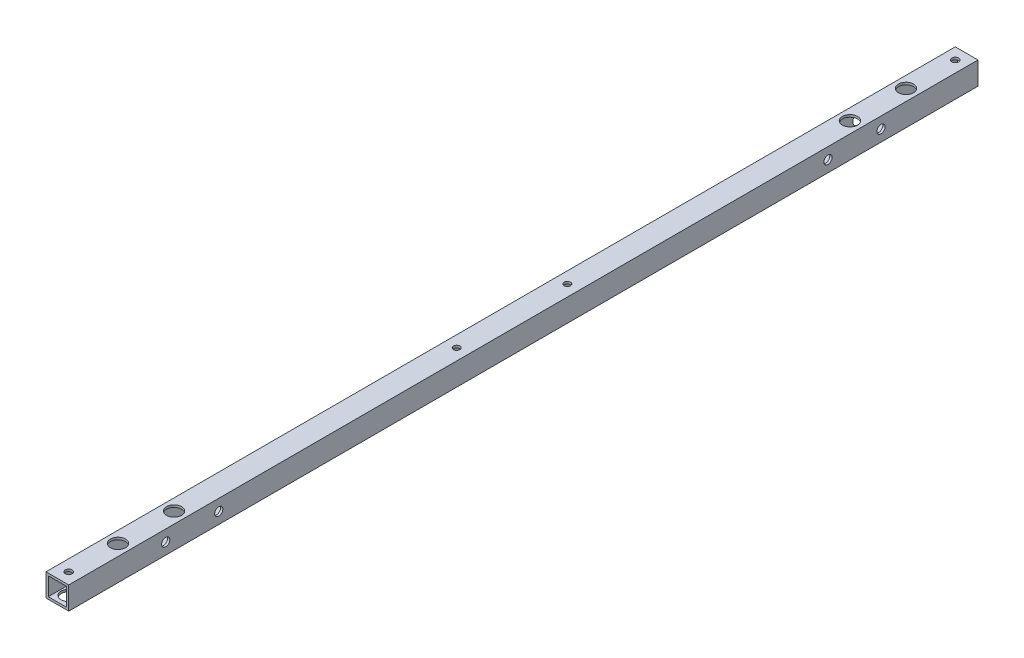
ISO-10303-21;
HEADER;
FILE_DESCRIPTION(('STEP AP214'),'2;1');
FILE_NAME('part.step','',(''),(''),'','','');
FILE_SCHEMA(('AUTOMOTIVE_DESIGN { 1 0 10303 214 1 1 1 1 }'));
ENDSEC;
DATA;
#1=APPLICATION_CONTEXT('core data for automotive mechanical design processes');
#2=APPLICATION_PROTOCOL_DEFINITION('international standard','automotive_design',2000,#1);
#3=PRODUCT_CONTEXT('',#1,'mechanical');
#4=PRODUCT('Part','Part','',(#3));
#5=PRODUCT_RELATED_PRODUCT_CATEGORY('part','',(#4));
#6=PRODUCT_DEFINITION_FORMATION('','',#4);
#7=PRODUCT_DEFINITION_CONTEXT('part definition',#1,'design');
#8=PRODUCT_DEFINITION('design','',#6,#7);
#9=PRODUCT_DEFINITION_SHAPE('','',#8);
#10=(LENGTH_UNIT() NAMED_UNIT(*) SI_UNIT(.MILLI.,.METRE.));
#11=(NAMED_UNIT(*) PLANE_ANGLE_UNIT() SI_UNIT($,.RADIAN.));
#12=(NAMED_UNIT(*) SI_UNIT($,.STERADIAN.) SOLID_ANGLE_UNIT());
#13=UNCERTAINTY_MEASURE_WITH_UNIT(LENGTH_MEASURE(1.E-05),#10,'distance_accuracy_value','');
#14=(GEOMETRIC_REPRESENTATION_CONTEXT(3) GLOBAL_UNCERTAINTY_ASSIGNED_CONTEXT((#13)) GLOBAL_UNIT_ASSIGNED_CONTEXT((#10,
#11,#12)) REPRESENTATION_CONTEXT('',''));
#15=CARTESIAN_POINT('',(0.,0.,0.));
#16=DIRECTION('',(0.,0.,1.));
#17=DIRECTION('',(1.,0.,0.));
#18=AXIS2_PLACEMENT_3D('',#15,#16,#17);
#19=CARTESIAN_POINT('',(-7.5,-7.5,600.));
#20=DIRECTION('',(1.,0.,0.));
#21=DIRECTION('',(0.,0.,-1.));
#22=AXIS2_PLACEMENT_3D('',#19,#20,#21);
#23=PLANE('',#22);
#24=CARTESIAN_POINT('',(-7.5,0.,536.));
#25=DIRECTION('',(-1.,0.,0.));
#26=DIRECTION('',(0.,0.,1.));
#27=AXIS2_PLACEMENT_3D('',#24,#25,#26);
#28=CIRCLE('',#27,4.99999999999999);
#29=CARTESIAN_POINT('',(-7.5,0.,541.));
#30=VERTEX_POINT('',#29);
#31=EDGE_CURVE('E427',#30,#30,#28,.T.);
#32=ORIENTED_EDGE('',*,*,#31,.F.);
#33=EDGE_LOOP('',(#32));
#34=FACE_BOUND('',#33,.T.);
#35=DIRECTION('',(0.,-1.,0.));
#36=VECTOR('',#35,1.);
#37=CARTESIAN_POINT('',(-7.5,-7.5,0.));
#38=LINE('',#37,#36);
#39=CARTESIAN_POINT('',(-7.5,7.5,0.));
#40=VERTEX_POINT('',#39);
#41=CARTESIAN_POINT('',(-7.5,-7.5,0.));
#42=VERTEX_POINT('',#41);
#43=EDGE_CURVE('E160',#40,#42,#38,.T.);
#44=ORIENTED_EDGE('',*,*,#43,.T.);
#45=DIRECTION('',(0.,0.,-1.));
#46=VECTOR('',#45,1.);
#47=CARTESIAN_POINT('',(-7.5,-7.5,600.));
#48=LINE('',#47,#46);
#49=CARTESIAN_POINT('',(-7.5,-7.5,600.));
#50=VERTEX_POINT('',#49);
#51=EDGE_CURVE('E165',#50,#42,#48,.T.);
#52=ORIENTED_EDGE('',*,*,#51,.F.);
#53=DIRECTION('',(0.,-1.,0.));
#54=VECTOR('',#53,1.);
#55=CARTESIAN_POINT('',(-7.5,-7.5,600.));
#56=LINE('',#55,#54);
#57=CARTESIAN_POINT('',(-7.5,7.5,600.));
#58=VERTEX_POINT('',#57);
#59=EDGE_CURVE('E151',#58,#50,#56,.T.);
#60=ORIENTED_EDGE('',*,*,#59,.F.);
#61=DIRECTION('',(0.,0.,-1.));
#62=VECTOR('',#61,1.);
#63=CARTESIAN_POINT('',(-7.5,7.5,600.));
#64=LINE('',#63,#62);
#65=EDGE_CURVE('E48',#58,#40,#64,.T.);
#66=ORIENTED_EDGE('',*,*,#65,.T.);
#67=EDGE_LOOP('',(#44,#52,#60,#66));
#68=FACE_BOUND('',#67,.T.);
#69=CARTESIAN_POINT('',(-7.5,0.,501.));
#70=DIRECTION('',(-1.,0.,0.));
#71=DIRECTION('',(0.,0.,1.));
#72=AXIS2_PLACEMENT_3D('',#69,#70,#71);
#73=CIRCLE('',#72,4.99999999999999);
#74=CARTESIAN_POINT('',(-7.5,0.,506.));
#75=VERTEX_POINT('',#74);
#76=EDGE_CURVE('E605',#75,#75,#73,.T.);
#77=ORIENTED_EDGE('',*,*,#76,.F.);
#78=EDGE_LOOP('',(#77));
#79=FACE_BOUND('',#78,.T.);
#80=CARTESIAN_POINT('',(-7.5,0.,99.));
#81=DIRECTION('',(-1.,0.,0.));
#82=DIRECTION('',(0.,0.,1.));
#83=AXIS2_PLACEMENT_3D('',#80,#81,#82);
#84=CIRCLE('',#83,4.99999999999999);
#85=CARTESIAN_POINT('',(-7.5,0.,104.));
#86=VERTEX_POINT('',#85);
#87=EDGE_CURVE('E597',#86,#86,#84,.T.);
#88=ORIENTED_EDGE('',*,*,#87,.F.);
#89=EDGE_LOOP('',(#88));
#90=FACE_BOUND('',#89,.T.);
#91=CARTESIAN_POINT('',(-7.5,0.,64.));
#92=DIRECTION('',(-1.,0.,0.));
#93=DIRECTION('',(0.,0.,1.));
#94=AXIS2_PLACEMENT_3D('',#91,#92,#93);
#95=CIRCLE('',#94,4.99999999999999);
#96=CARTESIAN_POINT('',(-7.5,0.,69.));
#97=VERTEX_POINT('',#96);
#98=EDGE_CURVE('E594',#97,#97,#95,.T.);
#99=ORIENTED_EDGE('',*,*,#98,.F.);
#100=EDGE_LOOP('',(#99));
#101=FACE_BOUND('',#100,.T.);
#102=ADVANCED_FACE('F39',(#34,#68,#79,#90,#101),#23,.F.);
#103=CARTESIAN_POINT('',(-6.,-6.,600.));
#104=DIRECTION('',(1.,0.,0.));
#105=DIRECTION('',(0.,0.,-1.));
#106=AXIS2_PLACEMENT_3D('',#103,#104,#105);
#107=PLANE('',#106);
#108=CARTESIAN_POINT('',(-6.,0.,64.));
#109=DIRECTION('',(-1.,0.,0.));
#110=DIRECTION('',(0.,0.,1.));
#111=AXIS2_PLACEMENT_3D('',#108,#109,#110);
#112=CIRCLE('',#111,4.99999999999999);
#113=CARTESIAN_POINT('',(-6.,0.,69.));
#114=VERTEX_POINT('',#113);
#115=EDGE_CURVE('E591',#114,#114,#112,.T.);
#116=ORIENTED_EDGE('',*,*,#115,.T.);
#117=EDGE_LOOP('',(#116));
#118=FACE_BOUND('',#117,.T.);
#119=CARTESIAN_POINT('',(-6.,0.,99.));
#120=DIRECTION('',(-1.,0.,0.));
#121=DIRECTION('',(0.,0.,1.));
#122=AXIS2_PLACEMENT_3D('',#119,#120,#121);
#123=CIRCLE('',#122,4.99999999999999);
#124=CARTESIAN_POINT('',(-6.,0.,104.));
#125=VERTEX_POINT('',#124);
#126=EDGE_CURVE('E602',#125,#125,#123,.T.);
#127=ORIENTED_EDGE('',*,*,#126,.T.);
#128=EDGE_LOOP('',(#127));
#129=FACE_BOUND('',#128,.T.);
#130=CARTESIAN_POINT('',(-6.,0.,501.));
#131=DIRECTION('',(-1.,0.,0.));
#132=DIRECTION('',(0.,0.,1.));
#133=AXIS2_PLACEMENT_3D('',#130,#131,#132);
#134=CIRCLE('',#133,4.99999999999999);
#135=CARTESIAN_POINT('',(-6.,0.,506.));
#136=VERTEX_POINT('',#135);
#137=EDGE_CURVE('E433',#136,#136,#134,.T.);
#138=ORIENTED_EDGE('',*,*,#137,.T.);
#139=EDGE_LOOP('',(#138));
#140=FACE_BOUND('',#139,.T.);
#141=DIRECTION('',(0.,-1.,0.));
#142=VECTOR('',#141,1.);
#143=CARTESIAN_POINT('',(-6.,-6.,0.));
#144=LINE('',#143,#142);
#145=CARTESIAN_POINT('',(-6.,6.,0.));
#146=VERTEX_POINT('',#145);
#147=CARTESIAN_POINT('',(-6.,-6.,0.));
#148=VERTEX_POINT('',#147);
#149=EDGE_CURVE('E137',#146,#148,#144,.T.);
#150=ORIENTED_EDGE('',*,*,#149,.F.);
#151=DIRECTION('',(0.,0.,-1.));
#152=VECTOR('',#151,1.);
#153=CARTESIAN_POINT('',(-6.,6.,600.));
#154=LINE('',#153,#152);
#155=CARTESIAN_POINT('',(-6.,6.,600.));
#156=VERTEX_POINT('',#155);
#157=EDGE_CURVE('E123',#156,#146,#154,.T.);
#158=ORIENTED_EDGE('',*,*,#157,.F.);
#159=DIRECTION('',(0.,-1.,0.));
#160=VECTOR('',#159,1.);
#161=CARTESIAN_POINT('',(-6.,-6.,600.));
#162=LINE('',#161,#160);
#163=CARTESIAN_POINT('',(-6.,-6.,600.));
#164=VERTEX_POINT('',#163);
#165=EDGE_CURVE('E127',#156,#164,#162,.T.);
#166=ORIENTED_EDGE('',*,*,#165,.T.);
#167=DIRECTION('',(0.,0.,-1.));
#168=VECTOR('',#167,1.);
#169=CARTESIAN_POINT('',(-6.,-6.,600.));
#170=LINE('',#169,#168);
#171=EDGE_CURVE('E56',#164,#148,#170,.T.);
#172=ORIENTED_EDGE('',*,*,#171,.T.);
#173=EDGE_LOOP('',(#150,#158,#166,#172));
#174=FACE_BOUND('',#173,.T.);
#175=CARTESIAN_POINT('',(-6.,0.,536.));
#176=DIRECTION('',(-1.,0.,0.));
#177=DIRECTION('',(0.,0.,1.));
#178=AXIS2_PLACEMENT_3D('',#175,#176,#177);
#179=CIRCLE('',#178,4.99999999999999);
#180=CARTESIAN_POINT('',(-6.,0.,541.));
#181=VERTEX_POINT('',#180);
#182=EDGE_CURVE('E424',#181,#181,#179,.T.);
#183=ORIENTED_EDGE('',*,*,#182,.T.);
#184=EDGE_LOOP('',(#183));
#185=FACE_BOUND('',#184,.T.);
#186=ADVANCED_FACE('F318',(#118,#129,#140,#174,#185),#107,.T.);
#187=CARTESIAN_POINT('',(0.,0.,600.));
#188=DIRECTION('',(0.,0.,-1.));
#189=DIRECTION('',(-1.,0.,0.));
#190=AXIS2_PLACEMENT_3D('',#187,#188,#189);
#191=PLANE('',#190);
#192=DIRECTION('',(0.,1.,0.));
#193=VECTOR('',#192,1.);
#194=CARTESIAN_POINT('',(7.5,-7.5,600.));
#195=LINE('',#194,#193);
#196=CARTESIAN_POINT('',(7.5,-7.5,600.));
#197=VERTEX_POINT('',#196);
#198=CARTESIAN_POINT('',(7.5,7.5,600.));
#199=VERTEX_POINT('',#198);
#200=EDGE_CURVE('E145',#197,#199,#195,.T.);
#201=ORIENTED_EDGE('',*,*,#200,.T.);
#202=DIRECTION('',(-1.,0.,0.));
#203=VECTOR('',#202,1.);
#204=CARTESIAN_POINT('',(-7.5,7.5,600.));
#205=LINE('',#204,#203);
#206=EDGE_CURVE('E148',#199,#58,#205,.T.);
#207=ORIENTED_EDGE('',*,*,#206,.T.);
#208=ORIENTED_EDGE('',*,*,#59,.T.);
#209=DIRECTION('',(1.,0.,0.));
#210=VECTOR('',#209,1.);
#211=CARTESIAN_POINT('',(-7.5,-7.5,600.));
#212=LINE('',#211,#210);
#213=EDGE_CURVE('E153',#50,#197,#212,.T.);
#214=ORIENTED_EDGE('',*,*,#213,.T.);
#215=EDGE_LOOP('',(#201,#207,#208,#214));
#216=FACE_BOUND('',#215,.T.);
#217=DIRECTION('',(0.,1.,0.));
#218=VECTOR('',#217,1.);
#219=CARTESIAN_POINT('',(6.,-6.,600.));
#220=LINE('',#219,#218);
#221=CARTESIAN_POINT('',(6.,-6.,600.));
#222=VERTEX_POINT('',#221);
#223=CARTESIAN_POINT('',(6.,6.,600.));
#224=VERTEX_POINT('',#223);
#225=EDGE_CURVE('E106',#222,#224,#220,.T.);
#226=ORIENTED_EDGE('',*,*,#225,.F.);
#227=DIRECTION('',(1.,0.,0.));
#228=VECTOR('',#227,1.);
#229=CARTESIAN_POINT('',(-6.,-6.,600.));
#230=LINE('',#229,#228);
#231=EDGE_CURVE('E129',#164,#222,#230,.T.);
#232=ORIENTED_EDGE('',*,*,#231,.F.);
#233=ORIENTED_EDGE('',*,*,#165,.F.);
#234=DIRECTION('',(-1.,0.,0.));
#235=VECTOR('',#234,1.);
#236=CARTESIAN_POINT('',(-6.,6.,600.));
#237=LINE('',#236,#235);
#238=EDGE_CURVE('E114',#224,#156,#237,.T.);
#239=ORIENTED_EDGE('',*,*,#238,.F.);
#240=EDGE_LOOP('',(#226,#232,#233,#239));
#241=FACE_BOUND('',#240,.T.);
#242=ADVANCED_FACE('F126',(#216,#241),#191,.F.);
#243=CARTESIAN_POINT('',(0.,0.,0.));
#244=DIRECTION('',(0.,0.,-1.));
#245=DIRECTION('',(-1.,0.,0.));
#246=AXIS2_PLACEMENT_3D('',#243,#244,#245);
#247=PLANE('',#246);
#248=DIRECTION('',(0.,1.,0.));
#249=VECTOR('',#248,1.);
#250=CARTESIAN_POINT('',(7.5,-7.5,0.));
#251=LINE('',#250,#249);
#252=CARTESIAN_POINT('',(7.5,-7.5,0.));
#253=VERTEX_POINT('',#252);
#254=CARTESIAN_POINT('',(7.5,7.5,0.));
#255=VERTEX_POINT('',#254);
#256=EDGE_CURVE('E122',#253,#255,#251,.T.);
#257=ORIENTED_EDGE('',*,*,#256,.F.);
#258=DIRECTION('',(1.,0.,0.));
#259=VECTOR('',#258,1.);
#260=CARTESIAN_POINT('',(-7.5,-7.5,0.));
#261=LINE('',#260,#259);
#262=EDGE_CURVE('E149',#42,#253,#261,.T.);
#263=ORIENTED_EDGE('',*,*,#262,.F.);
#264=ORIENTED_EDGE('',*,*,#43,.F.);
#265=DIRECTION('',(-1.,0.,0.));
#266=VECTOR('',#265,1.);
#267=CARTESIAN_POINT('',(-7.5,7.5,0.));
#268=LINE('',#267,#266);
#269=EDGE_CURVE('E158',#255,#40,#268,.T.);
#270=ORIENTED_EDGE('',*,*,#269,.F.);
#271=EDGE_LOOP('',(#257,#263,#264,#270));
#272=FACE_BOUND('',#271,.T.);
#273=DIRECTION('',(1.,0.,0.));
#274=VECTOR('',#273,1.);
#275=CARTESIAN_POINT('',(-6.,-6.,0.));
#276=LINE('',#275,#274);
#277=CARTESIAN_POINT('',(6.,-6.,0.));
#278=VERTEX_POINT('',#277);
#279=EDGE_CURVE('E115',#148,#278,#276,.T.);
#280=ORIENTED_EDGE('',*,*,#279,.T.);
#281=DIRECTION('',(0.,1.,0.));
#282=VECTOR('',#281,1.);
#283=CARTESIAN_POINT('',(6.,-6.,0.));
#284=LINE('',#283,#282);
#285=CARTESIAN_POINT('',(6.,6.,0.));
#286=VERTEX_POINT('',#285);
#287=EDGE_CURVE('E64',#278,#286,#284,.T.);
#288=ORIENTED_EDGE('',*,*,#287,.T.);
#289=DIRECTION('',(-1.,0.,0.));
#290=VECTOR('',#289,1.);
#291=CARTESIAN_POINT('',(-6.,6.,0.));
#292=LINE('',#291,#290);
#293=EDGE_CURVE('E121',#286,#146,#292,.T.);
#294=ORIENTED_EDGE('',*,*,#293,.T.);
#295=ORIENTED_EDGE('',*,*,#149,.T.);
#296=EDGE_LOOP('',(#280,#288,#294,#295));
#297=FACE_BOUND('',#296,.T.);
#298=ADVANCED_FACE('F309',(#272,#297),#247,.T.);
#299=CARTESIAN_POINT('',(7.5,-7.5,600.));
#300=DIRECTION('',(-1.,0.,0.));
#301=DIRECTION('',(0.,0.,1.));
#302=AXIS2_PLACEMENT_3D('',#299,#300,#301);
#303=PLANE('',#302);
#304=CARTESIAN_POINT('',(7.5,0.,536.));
#305=DIRECTION('',(1.,0.,0.));
#306=DIRECTION('',(0.,0.,-1.));
#307=AXIS2_PLACEMENT_3D('',#304,#305,#306);
#308=CIRCLE('',#307,2.70000000000001);
#309=CARTESIAN_POINT('',(7.5,0.,533.3));
#310=VERTEX_POINT('',#309);
#311=EDGE_CURVE('E244',#310,#310,#308,.T.);
#312=ORIENTED_EDGE('',*,*,#311,.F.);
#313=EDGE_LOOP('',(#312));
#314=FACE_BOUND('',#313,.T.);
#315=CARTESIAN_POINT('',(7.5,0.,501.));
#316=DIRECTION('',(1.,0.,0.));
#317=DIRECTION('',(0.,0.,-1.));
#318=AXIS2_PLACEMENT_3D('',#315,#316,#317);
#319=CIRCLE('',#318,2.69999999999996);
#320=CARTESIAN_POINT('',(7.5,0.,498.3));
#321=VERTEX_POINT('',#320);
#322=EDGE_CURVE('E248',#321,#321,#319,.T.);
#323=ORIENTED_EDGE('',*,*,#322,.F.);
#324=EDGE_LOOP('',(#323));
#325=FACE_BOUND('',#324,.T.);
#326=CARTESIAN_POINT('',(7.5,0.,99.));
#327=DIRECTION('',(1.,0.,0.));
#328=DIRECTION('',(0.,0.,-1.));
#329=AXIS2_PLACEMENT_3D('',#326,#327,#328);
#330=CIRCLE('',#329,2.7);
#331=CARTESIAN_POINT('',(7.5,0.,96.3));
#332=VERTEX_POINT('',#331);
#333=EDGE_CURVE('E251',#332,#332,#330,.T.);
#334=ORIENTED_EDGE('',*,*,#333,.F.);
#335=EDGE_LOOP('',(#334));
#336=FACE_BOUND('',#335,.T.);
#337=CARTESIAN_POINT('',(7.5,0.,64.));
#338=DIRECTION('',(1.,0.,0.));
#339=DIRECTION('',(0.,0.,-1.));
#340=AXIS2_PLACEMENT_3D('',#337,#338,#339);
#341=CIRCLE('',#340,2.7);
#342=CARTESIAN_POINT('',(7.5,0.,61.3));
#343=VERTEX_POINT('',#342);
#344=EDGE_CURVE('E243',#343,#343,#341,.T.);
#345=ORIENTED_EDGE('',*,*,#344,.F.);
#346=EDGE_LOOP('',(#345));
#347=FACE_BOUND('',#346,.T.);
#348=ORIENTED_EDGE('',*,*,#256,.T.);
#349=DIRECTION('',(0.,0.,-1.));
#350=VECTOR('',#349,1.);
#351=CARTESIAN_POINT('',(7.5,7.5,600.));
#352=LINE('',#351,#350);
#353=EDGE_CURVE('E11',#199,#255,#352,.T.);
#354=ORIENTED_EDGE('',*,*,#353,.F.);
#355=ORIENTED_EDGE('',*,*,#200,.F.);
#356=DIRECTION('',(0.,0.,-1.));
#357=VECTOR('',#356,1.);
#358=CARTESIAN_POINT('',(7.5,-7.5,600.));
#359=LINE('',#358,#357);
#360=EDGE_CURVE('E155',#197,#253,#359,.T.);
#361=ORIENTED_EDGE('',*,*,#360,.T.);
#362=EDGE_LOOP('',(#348,#354,#355,#361));
#363=FACE_BOUND('',#362,.T.);
#364=ADVANCED_FACE('F41',(#314,#325,#336,#347,#363),#303,.F.);
#365=CARTESIAN_POINT('',(-7.5,7.5,600.));
#366=DIRECTION('',(0.,-1.,0.));
#367=DIRECTION('',(0.,0.,-1.));
#368=AXIS2_PLACEMENT_3D('',#365,#366,#367);
#369=PLANE('',#368);
#370=CARTESIAN_POINT('',(0.,7.5,40.));
#371=DIRECTION('',(0.,1.,0.));
#372=DIRECTION('',(0.,0.,1.));
#373=AXIS2_PLACEMENT_3D('',#370,#371,#372);
#374=CIRCLE('',#373,4.99999999999958);
#375=CARTESIAN_POINT('',(0.,7.5,44.9999999999996));
#376=VERTEX_POINT('',#375);
#377=EDGE_CURVE('E202',#376,#376,#374,.T.);
#378=ORIENTED_EDGE('',*,*,#377,.F.);
#379=EDGE_LOOP('',(#378));
#380=FACE_BOUND('',#379,.T.);
#381=CARTESIAN_POINT('',(-1.81712284108571E-12,7.5,522.999999999999));
#382=DIRECTION('',(0.,1.,0.));
#383=DIRECTION('',(0.,0.,1.));
#384=AXIS2_PLACEMENT_3D('',#381,#382,#383);
#385=CIRCLE('',#384,5.);
#386=CARTESIAN_POINT('',(-1.81712284108571E-12,7.5,527.999999999999));
#387=VERTEX_POINT('',#386);
#388=EDGE_CURVE('E426',#387,#387,#385,.T.);
#389=ORIENTED_EDGE('',*,*,#388,.F.);
#390=EDGE_LOOP('',(#389));
#391=FACE_BOUND('',#390,.T.);
#392=CARTESIAN_POINT('',(0.,7.5,560.));
#393=DIRECTION('',(0.,1.,0.));
#394=DIRECTION('',(0.,0.,1.));
#395=AXIS2_PLACEMENT_3D('',#392,#393,#394);
#396=CIRCLE('',#395,5.);
#397=CARTESIAN_POINT('',(0.,7.5,565.));
#398=VERTEX_POINT('',#397);
#399=EDGE_CURVE('E430',#398,#398,#396,.T.);
#400=ORIENTED_EDGE('',*,*,#399,.F.);
#401=EDGE_LOOP('',(#400));
#402=FACE_BOUND('',#401,.T.);
#403=CARTESIAN_POINT('',(0.,7.5,77.));
#404=DIRECTION('',(0.,1.,0.));
#405=DIRECTION('',(0.,0.,1.));
#406=AXIS2_PLACEMENT_3D('',#403,#404,#405);
#407=CIRCLE('',#406,5.);
#408=CARTESIAN_POINT('',(0.,7.5,82.));
#409=VERTEX_POINT('',#408);
#410=EDGE_CURVE('E438',#409,#409,#407,.T.);
#411=ORIENTED_EDGE('',*,*,#410,.F.);
#412=EDGE_LOOP('',(#411));
#413=FACE_BOUND('',#412,.T.);
#414=CARTESIAN_POINT('',(0.,7.5,336.5));
#415=DIRECTION('',(0.,1.,0.));
#416=DIRECTION('',(0.,0.,1.));
#417=AXIS2_PLACEMENT_3D('',#414,#415,#416);
#418=CIRCLE('',#417,2.1);
#419=CARTESIAN_POINT('',(0.,7.5,338.6));
#420=VERTEX_POINT('',#419);
#421=EDGE_CURVE('E232',#420,#420,#418,.T.);
#422=ORIENTED_EDGE('',*,*,#421,.F.);
#423=EDGE_LOOP('',(#422));
#424=FACE_BOUND('',#423,.T.);
#425=CARTESIAN_POINT('',(0.,7.5,263.5));
#426=DIRECTION('',(0.,1.,0.));
#427=DIRECTION('',(0.,0.,1.));
#428=AXIS2_PLACEMENT_3D('',#425,#426,#427);
#429=CIRCLE('',#428,2.1);
#430=CARTESIAN_POINT('',(0.,7.5,265.6));
#431=VERTEX_POINT('',#430);
#432=EDGE_CURVE('E183',#431,#431,#429,.T.);
#433=ORIENTED_EDGE('',*,*,#432,.F.);
#434=EDGE_LOOP('',(#433));
#435=FACE_BOUND('',#434,.T.);
#436=CARTESIAN_POINT('',(0.,7.5,7.49999999999995));
#437=DIRECTION('',(0.,1.,0.));
#438=DIRECTION('',(0.,0.,1.));
#439=AXIS2_PLACEMENT_3D('',#436,#437,#438);
#440=CIRCLE('',#439,2.25);
#441=CARTESIAN_POINT('',(0.,7.5,9.74999999999995));
#442=VERTEX_POINT('',#441);
#443=EDGE_CURVE('E268',#442,#442,#440,.T.);
#444=ORIENTED_EDGE('',*,*,#443,.F.);
#445=EDGE_LOOP('',(#444));
#446=FACE_BOUND('',#445,.T.);
#447=CARTESIAN_POINT('',(0.,7.5,592.5));
#448=DIRECTION('',(0.,1.,0.));
#449=DIRECTION('',(0.,0.,1.));
#450=AXIS2_PLACEMENT_3D('',#447,#448,#449);
#451=CIRCLE('',#450,2.24999999999998);
#452=CARTESIAN_POINT('',(0.,7.5,594.75));
#453=VERTEX_POINT('',#452);
#454=EDGE_CURVE('E267',#453,#453,#451,.T.);
#455=ORIENTED_EDGE('',*,*,#454,.F.);
#456=EDGE_LOOP('',(#455));
#457=FACE_BOUND('',#456,.T.);
#458=ORIENTED_EDGE('',*,*,#269,.T.);
#459=ORIENTED_EDGE('',*,*,#65,.F.);
#460=ORIENTED_EDGE('',*,*,#206,.F.);
#461=ORIENTED_EDGE('',*,*,#353,.T.);
#462=EDGE_LOOP('',(#458,#459,#460,#461));
#463=FACE_BOUND('',#462,.T.);
#464=ADVANCED_FACE('F294',(#380,#391,#402,#413,#424,#435,#446,#457,#463),#369,.F.);
#465=CARTESIAN_POINT('',(-7.5,-7.5,600.));
#466=DIRECTION('',(0.,1.,0.));
#467=DIRECTION('',(0.,0.,1.));
#468=AXIS2_PLACEMENT_3D('',#465,#466,#467);
#469=PLANE('',#468);
#470=CARTESIAN_POINT('',(0.,-7.5,40.));
#471=DIRECTION('',(0.,-1.,0.));
#472=DIRECTION('',(0.,0.,-1.));
#473=AXIS2_PLACEMENT_3D('',#470,#471,#472);
#474=CIRCLE('',#473,2.7);
#475=CARTESIAN_POINT('',(0.,-7.5,37.3));
#476=VERTEX_POINT('',#475);
#477=EDGE_CURVE('E188',#476,#476,#474,.T.);
#478=ORIENTED_EDGE('',*,*,#477,.F.);
#479=EDGE_LOOP('',(#478));
#480=FACE_BOUND('',#479,.T.);
#481=CARTESIAN_POINT('',(0.,-7.5,77.));
#482=DIRECTION('',(0.,-1.,0.));
#483=DIRECTION('',(0.,0.,-1.));
#484=AXIS2_PLACEMENT_3D('',#481,#482,#483);
#485=CIRCLE('',#484,2.7);
#486=CARTESIAN_POINT('',(0.,-7.5,74.3));
#487=VERTEX_POINT('',#486);
#488=EDGE_CURVE('E218',#487,#487,#485,.T.);
#489=ORIENTED_EDGE('',*,*,#488,.F.);
#490=EDGE_LOOP('',(#489));
#491=FACE_BOUND('',#490,.T.);
#492=CARTESIAN_POINT('',(-1.65681026646183E-12,-7.5,523.));
#493=DIRECTION('',(0.,-1.,0.));
#494=DIRECTION('',(0.,0.,-1.));
#495=AXIS2_PLACEMENT_3D('',#492,#493,#494);
#496=CIRCLE('',#495,2.69999999999999);
#497=CARTESIAN_POINT('',(-1.65681026646183E-12,-7.5,520.3));
#498=VERTEX_POINT('',#497);
#499=EDGE_CURVE('E213',#498,#498,#496,.T.);
#500=ORIENTED_EDGE('',*,*,#499,.F.);
#501=EDGE_LOOP('',(#500));
#502=FACE_BOUND('',#501,.T.);
#503=CARTESIAN_POINT('',(0.,-7.5,560.));
#504=DIRECTION('',(0.,-1.,0.));
#505=DIRECTION('',(0.,0.,-1.));
#506=AXIS2_PLACEMENT_3D('',#503,#504,#505);
#507=CIRCLE('',#506,2.69999999999999);
#508=CARTESIAN_POINT('',(0.,-7.5,557.3));
#509=VERTEX_POINT('',#508);
#510=EDGE_CURVE('E209',#509,#509,#507,.T.);
#511=ORIENTED_EDGE('',*,*,#510,.F.);
#512=EDGE_LOOP('',(#511));
#513=FACE_BOUND('',#512,.T.);
#514=CARTESIAN_POINT('',(0.,-7.5,592.5));
#515=DIRECTION('',(0.,-1.,0.));
#516=DIRECTION('',(0.,0.,-1.));
#517=AXIS2_PLACEMENT_3D('',#514,#515,#516);
#518=CIRCLE('',#517,5.);
#519=CARTESIAN_POINT('',(0.,-7.5,587.5));
#520=VERTEX_POINT('',#519);
#521=EDGE_CURVE('E174',#520,#520,#518,.T.);
#522=ORIENTED_EDGE('',*,*,#521,.F.);
#523=EDGE_LOOP('',(#522));
#524=FACE_BOUND('',#523,.T.);
#525=CARTESIAN_POINT('',(0.,-7.5,336.5));
#526=DIRECTION('',(0.,-1.,0.));
#527=DIRECTION('',(0.,0.,-1.));
#528=AXIS2_PLACEMENT_3D('',#525,#526,#527);
#529=CIRCLE('',#528,5.);
#530=CARTESIAN_POINT('',(0.,-7.5,331.5));
#531=VERTEX_POINT('',#530);
#532=EDGE_CURVE('E224',#531,#531,#529,.T.);
#533=ORIENTED_EDGE('',*,*,#532,.F.);
#534=EDGE_LOOP('',(#533));
#535=FACE_BOUND('',#534,.T.);
#536=CARTESIAN_POINT('',(0.,-7.5,263.5));
#537=DIRECTION('',(0.,-1.,0.));
#538=DIRECTION('',(0.,0.,-1.));
#539=AXIS2_PLACEMENT_3D('',#536,#537,#538);
#540=CIRCLE('',#539,5.);
#541=CARTESIAN_POINT('',(0.,-7.5,258.5));
#542=VERTEX_POINT('',#541);
#543=EDGE_CURVE('E227',#542,#542,#540,.T.);
#544=ORIENTED_EDGE('',*,*,#543,.F.);
#545=EDGE_LOOP('',(#544));
#546=FACE_BOUND('',#545,.T.);
#547=CARTESIAN_POINT('',(0.,-7.5,7.49999999999995));
#548=DIRECTION('',(0.,-1.,0.));
#549=DIRECTION('',(0.,0.,-1.));
#550=AXIS2_PLACEMENT_3D('',#547,#548,#549);
#551=CIRCLE('',#550,5.);
#552=CARTESIAN_POINT('',(0.,-7.5,2.49999999999995));
#553=VERTEX_POINT('',#552);
#554=EDGE_CURVE('E197',#553,#553,#551,.T.);
#555=ORIENTED_EDGE('',*,*,#554,.F.);
#556=EDGE_LOOP('',(#555));
#557=FACE_BOUND('',#556,.T.);
#558=ORIENTED_EDGE('',*,*,#262,.T.);
#559=ORIENTED_EDGE('',*,*,#360,.F.);
#560=ORIENTED_EDGE('',*,*,#213,.F.);
#561=ORIENTED_EDGE('',*,*,#51,.T.);
#562=EDGE_LOOP('',(#558,#559,#560,#561));
#563=FACE_BOUND('',#562,.T.);
#564=ADVANCED_FACE('F297',(#480,#491,#502,#513,#524,#535,#546,#557,#563),#469,.F.);
#565=CARTESIAN_POINT('',(6.,-6.,600.));
#566=DIRECTION('',(-1.,0.,0.));
#567=DIRECTION('',(0.,0.,1.));
#568=AXIS2_PLACEMENT_3D('',#565,#566,#567);
#569=PLANE('',#568);
#570=CARTESIAN_POINT('',(6.,0.,536.));
#571=DIRECTION('',(-1.,0.,0.));
#572=DIRECTION('',(0.,0.,1.));
#573=AXIS2_PLACEMENT_3D('',#570,#571,#572);
#574=CIRCLE('',#573,2.70000000000001);
#575=CARTESIAN_POINT('',(6.,0.,538.7));
#576=VERTEX_POINT('',#575);
#577=EDGE_CURVE('E264',#576,#576,#574,.T.);
#578=ORIENTED_EDGE('',*,*,#577,.F.);
#579=EDGE_LOOP('',(#578));
#580=FACE_BOUND('',#579,.T.);
#581=CARTESIAN_POINT('',(6.,0.,501.));
#582=DIRECTION('',(-1.,0.,0.));
#583=DIRECTION('',(0.,0.,1.));
#584=AXIS2_PLACEMENT_3D('',#581,#582,#583);
#585=CIRCLE('',#584,2.69999999999996);
#586=CARTESIAN_POINT('',(6.,0.,503.7));
#587=VERTEX_POINT('',#586);
#588=EDGE_CURVE('E261',#587,#587,#585,.T.);
#589=ORIENTED_EDGE('',*,*,#588,.F.);
#590=EDGE_LOOP('',(#589));
#591=FACE_BOUND('',#590,.T.);
#592=CARTESIAN_POINT('',(6.,0.,99.));
#593=DIRECTION('',(-1.,0.,0.));
#594=DIRECTION('',(0.,0.,1.));
#595=AXIS2_PLACEMENT_3D('',#592,#593,#594);
#596=CIRCLE('',#595,2.7);
#597=CARTESIAN_POINT('',(6.,0.,101.7));
#598=VERTEX_POINT('',#597);
#599=EDGE_CURVE('E258',#598,#598,#596,.T.);
#600=ORIENTED_EDGE('',*,*,#599,.F.);
#601=EDGE_LOOP('',(#600));
#602=FACE_BOUND('',#601,.T.);
#603=CARTESIAN_POINT('',(6.,0.,64.));
#604=DIRECTION('',(-1.,0.,0.));
#605=DIRECTION('',(0.,0.,1.));
#606=AXIS2_PLACEMENT_3D('',#603,#604,#605);
#607=CIRCLE('',#606,2.7);
#608=CARTESIAN_POINT('',(6.,0.,66.7));
#609=VERTEX_POINT('',#608);
#610=EDGE_CURVE('E247',#609,#609,#607,.T.);
#611=ORIENTED_EDGE('',*,*,#610,.F.);
#612=EDGE_LOOP('',(#611));
#613=FACE_BOUND('',#612,.T.);
#614=ORIENTED_EDGE('',*,*,#287,.F.);
#615=DIRECTION('',(0.,0.,-1.));
#616=VECTOR('',#615,1.);
#617=CARTESIAN_POINT('',(6.,-6.,600.));
#618=LINE('',#617,#616);
#619=EDGE_CURVE('E110',#222,#278,#618,.T.);
#620=ORIENTED_EDGE('',*,*,#619,.F.);
#621=ORIENTED_EDGE('',*,*,#225,.T.);
#622=DIRECTION('',(0.,0.,-1.));
#623=VECTOR('',#622,1.);
#624=CARTESIAN_POINT('',(6.,6.,600.));
#625=LINE('',#624,#623);
#626=EDGE_CURVE('E109',#224,#286,#625,.T.);
#627=ORIENTED_EDGE('',*,*,#626,.T.);
#628=EDGE_LOOP('',(#614,#620,#621,#627));
#629=FACE_BOUND('',#628,.T.);
#630=ADVANCED_FACE('F108',(#580,#591,#602,#613,#629),#569,.T.);
#631=CARTESIAN_POINT('',(-6.,6.,600.));
#632=DIRECTION('',(0.,-1.,0.));
#633=DIRECTION('',(0.,0.,-1.));
#634=AXIS2_PLACEMENT_3D('',#631,#632,#633);
#635=PLANE('',#634);
#636=CARTESIAN_POINT('',(0.,6.,40.));
#637=DIRECTION('',(0.,-1.,0.));
#638=DIRECTION('',(0.,0.,-1.));
#639=AXIS2_PLACEMENT_3D('',#636,#637,#638);
#640=CIRCLE('',#639,4.99999999999958);
#641=CARTESIAN_POINT('',(0.,6.,35.0000000000004));
#642=VERTEX_POINT('',#641);
#643=EDGE_CURVE('E43',#642,#642,#640,.T.);
#644=ORIENTED_EDGE('',*,*,#643,.F.);
#645=EDGE_LOOP('',(#644));
#646=FACE_BOUND('',#645,.T.);
#647=CARTESIAN_POINT('',(-1.81712284108571E-12,6.,522.999999999999));
#648=DIRECTION('',(0.,-1.,0.));
#649=DIRECTION('',(0.,0.,-1.));
#650=AXIS2_PLACEMENT_3D('',#647,#648,#649);
#651=CIRCLE('',#650,5.);
#652=CARTESIAN_POINT('',(-1.81712284108571E-12,6.,517.999999999999));
#653=VERTEX_POINT('',#652);
#654=EDGE_CURVE('E204',#653,#653,#651,.T.);
#655=ORIENTED_EDGE('',*,*,#654,.F.);
#656=EDGE_LOOP('',(#655));
#657=FACE_BOUND('',#656,.T.);
#658=CARTESIAN_POINT('',(0.,6.,560.));
#659=DIRECTION('',(0.,-1.,0.));
#660=DIRECTION('',(0.,0.,-1.));
#661=AXIS2_PLACEMENT_3D('',#658,#659,#660);
#662=CIRCLE('',#661,5.);
#663=CARTESIAN_POINT('',(0.,6.,555.));
#664=VERTEX_POINT('',#663);
#665=EDGE_CURVE('E201',#664,#664,#662,.T.);
#666=ORIENTED_EDGE('',*,*,#665,.F.);
#667=EDGE_LOOP('',(#666));
#668=FACE_BOUND('',#667,.T.);
#669=CARTESIAN_POINT('',(0.,6.,77.));
#670=DIRECTION('',(0.,-1.,0.));
#671=DIRECTION('',(0.,0.,-1.));
#672=AXIS2_PLACEMENT_3D('',#669,#670,#671);
#673=CIRCLE('',#672,5.);
#674=CARTESIAN_POINT('',(0.,6.,72.));
#675=VERTEX_POINT('',#674);
#676=EDGE_CURVE('E198',#675,#675,#673,.T.);
#677=ORIENTED_EDGE('',*,*,#676,.F.);
#678=EDGE_LOOP('',(#677));
#679=FACE_BOUND('',#678,.T.);
#680=CARTESIAN_POINT('',(0.,6.,336.5));
#681=DIRECTION('',(0.,-1.,0.));
#682=DIRECTION('',(0.,0.,-1.));
#683=AXIS2_PLACEMENT_3D('',#680,#681,#682);
#684=CIRCLE('',#683,2.1);
#685=CARTESIAN_POINT('',(0.,6.,334.4));
#686=VERTEX_POINT('',#685);
#687=EDGE_CURVE('E240',#686,#686,#684,.T.);
#688=ORIENTED_EDGE('',*,*,#687,.F.);
#689=EDGE_LOOP('',(#688));
#690=FACE_BOUND('',#689,.T.);
#691=CARTESIAN_POINT('',(0.,6.,263.5));
#692=DIRECTION('',(0.,-1.,0.));
#693=DIRECTION('',(0.,0.,-1.));
#694=AXIS2_PLACEMENT_3D('',#691,#692,#693);
#695=CIRCLE('',#694,2.1);
#696=CARTESIAN_POINT('',(0.,6.,261.4));
#697=VERTEX_POINT('',#696);
#698=EDGE_CURVE('E235',#697,#697,#695,.T.);
#699=ORIENTED_EDGE('',*,*,#698,.F.);
#700=EDGE_LOOP('',(#699));
#701=FACE_BOUND('',#700,.T.);
#702=CARTESIAN_POINT('',(0.,6.,7.49999999999995));
#703=DIRECTION('',(0.,-1.,0.));
#704=DIRECTION('',(0.,0.,-1.));
#705=AXIS2_PLACEMENT_3D('',#702,#703,#704);
#706=CIRCLE('',#705,2.25);
#707=CARTESIAN_POINT('',(0.,6.,5.24999999999995));
#708=VERTEX_POINT('',#707);
#709=EDGE_CURVE('E135',#708,#708,#706,.T.);
#710=ORIENTED_EDGE('',*,*,#709,.F.);
#711=EDGE_LOOP('',(#710));
#712=FACE_BOUND('',#711,.T.);
#713=CARTESIAN_POINT('',(0.,6.,592.5));
#714=DIRECTION('',(0.,-1.,0.));
#715=DIRECTION('',(0.,0.,-1.));
#716=AXIS2_PLACEMENT_3D('',#713,#714,#715);
#717=CIRCLE('',#716,2.24999999999998);
#718=CARTESIAN_POINT('',(0.,6.,590.25));
#719=VERTEX_POINT('',#718);
#720=EDGE_CURVE('E271',#719,#719,#717,.T.);
#721=ORIENTED_EDGE('',*,*,#720,.F.);
#722=EDGE_LOOP('',(#721));
#723=FACE_BOUND('',#722,.T.);
#724=ORIENTED_EDGE('',*,*,#293,.F.);
#725=ORIENTED_EDGE('',*,*,#626,.F.);
#726=ORIENTED_EDGE('',*,*,#238,.T.);
#727=ORIENTED_EDGE('',*,*,#157,.T.);
#728=EDGE_LOOP('',(#724,#725,#726,#727));
#729=FACE_BOUND('',#728,.T.);
#730=ADVANCED_FACE('F118',(#646,#657,#668,#679,#690,#701,#712,#723,#729),#635,.T.);
#731=CARTESIAN_POINT('',(-6.,-6.,600.));
#732=DIRECTION('',(0.,1.,0.));
#733=DIRECTION('',(0.,0.,1.));
#734=AXIS2_PLACEMENT_3D('',#731,#732,#733);
#735=PLANE('',#734);
#736=CARTESIAN_POINT('',(0.,-6.,40.));
#737=DIRECTION('',(0.,1.,0.));
#738=DIRECTION('',(0.,0.,1.));
#739=AXIS2_PLACEMENT_3D('',#736,#737,#738);
#740=CIRCLE('',#739,2.7);
#741=CARTESIAN_POINT('',(0.,-6.,42.7));
#742=VERTEX_POINT('',#741);
#743=EDGE_CURVE('E194',#742,#742,#740,.T.);
#744=ORIENTED_EDGE('',*,*,#743,.F.);
#745=EDGE_LOOP('',(#744));
#746=FACE_BOUND('',#745,.T.);
#747=CARTESIAN_POINT('',(0.,-6.,77.));
#748=DIRECTION('',(0.,1.,0.));
#749=DIRECTION('',(0.,0.,1.));
#750=AXIS2_PLACEMENT_3D('',#747,#748,#749);
#751=CIRCLE('',#750,2.7);
#752=CARTESIAN_POINT('',(0.,-6.,79.7));
#753=VERTEX_POINT('',#752);
#754=EDGE_CURVE('E191',#753,#753,#751,.T.);
#755=ORIENTED_EDGE('',*,*,#754,.F.);
#756=EDGE_LOOP('',(#755));
#757=FACE_BOUND('',#756,.T.);
#758=CARTESIAN_POINT('',(-1.65681026646183E-12,-6.,523.));
#759=DIRECTION('',(0.,1.,0.));
#760=DIRECTION('',(0.,0.,1.));
#761=AXIS2_PLACEMENT_3D('',#758,#759,#760);
#762=CIRCLE('',#761,2.69999999999999);
#763=CARTESIAN_POINT('',(-1.65681026646183E-12,-6.,525.7));
#764=VERTEX_POINT('',#763);
#765=EDGE_CURVE('E187',#764,#764,#762,.T.);
#766=ORIENTED_EDGE('',*,*,#765,.F.);
#767=EDGE_LOOP('',(#766));
#768=FACE_BOUND('',#767,.T.);
#769=CARTESIAN_POINT('',(0.,-6.,560.));
#770=DIRECTION('',(0.,1.,0.));
#771=DIRECTION('',(0.,0.,1.));
#772=AXIS2_PLACEMENT_3D('',#769,#770,#771);
#773=CIRCLE('',#772,2.69999999999999);
#774=CARTESIAN_POINT('',(0.,-6.,562.7));
#775=VERTEX_POINT('',#774);
#776=EDGE_CURVE('E184',#775,#775,#773,.T.);
#777=ORIENTED_EDGE('',*,*,#776,.F.);
#778=EDGE_LOOP('',(#777));
#779=FACE_BOUND('',#778,.T.);
#780=CARTESIAN_POINT('',(0.,-6.,592.5));
#781=DIRECTION('',(0.,1.,0.));
#782=DIRECTION('',(0.,0.,1.));
#783=AXIS2_PLACEMENT_3D('',#780,#781,#782);
#784=CIRCLE('',#783,5.);
#785=CARTESIAN_POINT('',(0.,-6.,597.5));
#786=VERTEX_POINT('',#785);
#787=EDGE_CURVE('E180',#786,#786,#784,.T.);
#788=ORIENTED_EDGE('',*,*,#787,.F.);
#789=EDGE_LOOP('',(#788));
#790=FACE_BOUND('',#789,.T.);
#791=CARTESIAN_POINT('',(0.,-6.,336.5));
#792=DIRECTION('',(0.,1.,0.));
#793=DIRECTION('',(0.,0.,1.));
#794=AXIS2_PLACEMENT_3D('',#791,#792,#793);
#795=CIRCLE('',#794,5.);
#796=CARTESIAN_POINT('',(0.,-6.,341.5));
#797=VERTEX_POINT('',#796);
#798=EDGE_CURVE('E177',#797,#797,#795,.T.);
#799=ORIENTED_EDGE('',*,*,#798,.F.);
#800=EDGE_LOOP('',(#799));
#801=FACE_BOUND('',#800,.T.);
#802=CARTESIAN_POINT('',(0.,-6.,263.5));
#803=DIRECTION('',(0.,1.,0.));
#804=DIRECTION('',(0.,0.,1.));
#805=AXIS2_PLACEMENT_3D('',#802,#803,#804);
#806=CIRCLE('',#805,5.);
#807=CARTESIAN_POINT('',(0.,-6.,268.5));
#808=VERTEX_POINT('',#807);
#809=EDGE_CURVE('E173',#808,#808,#806,.T.);
#810=ORIENTED_EDGE('',*,*,#809,.F.);
#811=EDGE_LOOP('',(#810));
#812=FACE_BOUND('',#811,.T.);
#813=CARTESIAN_POINT('',(0.,-6.,7.49999999999995));
#814=DIRECTION('',(0.,1.,0.));
#815=DIRECTION('',(0.,0.,1.));
#816=AXIS2_PLACEMENT_3D('',#813,#814,#815);
#817=CIRCLE('',#816,5.);
#818=CARTESIAN_POINT('',(0.,-6.,12.5));
#819=VERTEX_POINT('',#818);
#820=EDGE_CURVE('E170',#819,#819,#817,.T.);
#821=ORIENTED_EDGE('',*,*,#820,.F.);
#822=EDGE_LOOP('',(#821));
#823=FACE_BOUND('',#822,.T.);
#824=ORIENTED_EDGE('',*,*,#279,.F.);
#825=ORIENTED_EDGE('',*,*,#171,.F.);
#826=ORIENTED_EDGE('',*,*,#231,.T.);
#827=ORIENTED_EDGE('',*,*,#619,.T.);
#828=EDGE_LOOP('',(#824,#825,#826,#827));
#829=FACE_BOUND('',#828,.T.);
#830=ADVANCED_FACE('F283',(#746,#757,#768,#779,#790,#801,#812,#823,#829),#735,.T.);
#831=CARTESIAN_POINT('',(0.,-17.5,592.5));
#832=DIRECTION('',(0.,1.,0.));
#833=DIRECTION('',(0.,0.,1.));
#834=AXIS2_PLACEMENT_3D('',#831,#832,#833);
#835=CYLINDRICAL_SURFACE('',#834,2.24999999999998);
#836=ORIENTED_EDGE('',*,*,#720,.T.);
#837=EDGE_LOOP('',(#836));
#838=FACE_BOUND('',#837,.T.);
#839=ORIENTED_EDGE('',*,*,#454,.T.);
#840=EDGE_LOOP('',(#839));
#841=FACE_BOUND('',#840,.T.);
#842=ADVANCED_FACE('F288',(#838,#841),#835,.F.);
#843=CARTESIAN_POINT('',(0.,-17.5,7.49999999999995));
#844=DIRECTION('',(0.,1.,0.));
#845=DIRECTION('',(0.,0.,1.));
#846=AXIS2_PLACEMENT_3D('',#843,#844,#845);
#847=CYLINDRICAL_SURFACE('',#846,2.25);
#848=ORIENTED_EDGE('',*,*,#709,.T.);
#849=EDGE_LOOP('',(#848));
#850=FACE_BOUND('',#849,.T.);
#851=ORIENTED_EDGE('',*,*,#443,.T.);
#852=EDGE_LOOP('',(#851));
#853=FACE_BOUND('',#852,.T.);
#854=ADVANCED_FACE('F278',(#850,#853),#847,.F.);
#855=CARTESIAN_POINT('',(-12.5,0.,64.));
#856=DIRECTION('',(1.,0.,0.));
#857=DIRECTION('',(0.,0.,-1.));
#858=AXIS2_PLACEMENT_3D('',#855,#856,#857);
#859=CYLINDRICAL_SURFACE('',#858,2.7);
#860=ORIENTED_EDGE('',*,*,#610,.T.);
#861=EDGE_LOOP('',(#860));
#862=FACE_BOUND('',#861,.T.);
#863=ORIENTED_EDGE('',*,*,#344,.T.);
#864=EDGE_LOOP('',(#863));
#865=FACE_BOUND('',#864,.T.);
#866=ADVANCED_FACE('F393',(#862,#865),#859,.F.);
#867=CARTESIAN_POINT('',(-12.5,0.,99.));
#868=DIRECTION('',(1.,0.,0.));
#869=DIRECTION('',(0.,0.,-1.));
#870=AXIS2_PLACEMENT_3D('',#867,#868,#869);
#871=CYLINDRICAL_SURFACE('',#870,2.7);
#872=ORIENTED_EDGE('',*,*,#599,.T.);
#873=EDGE_LOOP('',(#872));
#874=FACE_BOUND('',#873,.T.);
#875=ORIENTED_EDGE('',*,*,#333,.T.);
#876=EDGE_LOOP('',(#875));
#877=FACE_BOUND('',#876,.T.);
#878=ADVANCED_FACE('F389',(#874,#877),#871,.F.);
#879=CARTESIAN_POINT('',(-12.5,0.,501.));
#880=DIRECTION('',(1.,0.,0.));
#881=DIRECTION('',(0.,0.,-1.));
#882=AXIS2_PLACEMENT_3D('',#879,#880,#881);
#883=CYLINDRICAL_SURFACE('',#882,2.69999999999996);
#884=ORIENTED_EDGE('',*,*,#588,.T.);
#885=EDGE_LOOP('',(#884));
#886=FACE_BOUND('',#885,.T.);
#887=ORIENTED_EDGE('',*,*,#322,.T.);
#888=EDGE_LOOP('',(#887));
#889=FACE_BOUND('',#888,.T.);
#890=ADVANCED_FACE('F385',(#886,#889),#883,.F.);
#891=CARTESIAN_POINT('',(-12.5,0.,536.));
#892=DIRECTION('',(1.,0.,0.));
#893=DIRECTION('',(0.,0.,-1.));
#894=AXIS2_PLACEMENT_3D('',#891,#892,#893);
#895=CYLINDRICAL_SURFACE('',#894,2.70000000000001);
#896=ORIENTED_EDGE('',*,*,#577,.T.);
#897=EDGE_LOOP('',(#896));
#898=FACE_BOUND('',#897,.T.);
#899=ORIENTED_EDGE('',*,*,#311,.T.);
#900=EDGE_LOOP('',(#899));
#901=FACE_BOUND('',#900,.T.);
#902=ADVANCED_FACE('F381',(#898,#901),#895,.F.);
#903=CARTESIAN_POINT('',(0.,-12.5,263.5));
#904=DIRECTION('',(0.,1.,0.));
#905=DIRECTION('',(0.,0.,1.));
#906=AXIS2_PLACEMENT_3D('',#903,#904,#905);
#907=CYLINDRICAL_SURFACE('',#906,2.1);
#908=ORIENTED_EDGE('',*,*,#698,.T.);
#909=EDGE_LOOP('',(#908));
#910=FACE_BOUND('',#909,.T.);
#911=ORIENTED_EDGE('',*,*,#432,.T.);
#912=EDGE_LOOP('',(#911));
#913=FACE_BOUND('',#912,.T.);
#914=ADVANCED_FACE('F374',(#910,#913),#907,.F.);
#915=CARTESIAN_POINT('',(0.,-12.5,336.5));
#916=DIRECTION('',(0.,1.,0.));
#917=DIRECTION('',(0.,0.,1.));
#918=AXIS2_PLACEMENT_3D('',#915,#916,#917);
#919=CYLINDRICAL_SURFACE('',#918,2.1);
#920=ORIENTED_EDGE('',*,*,#687,.T.);
#921=EDGE_LOOP('',(#920));
#922=FACE_BOUND('',#921,.T.);
#923=ORIENTED_EDGE('',*,*,#421,.T.);
#924=EDGE_LOOP('',(#923));
#925=FACE_BOUND('',#924,.T.);
#926=ADVANCED_FACE('F364',(#922,#925),#919,.F.);
#927=CARTESIAN_POINT('',(0.,2.5,7.49999999999995));
#928=DIRECTION('',(0.,-1.,0.));
#929=DIRECTION('',(0.,0.,-1.));
#930=AXIS2_PLACEMENT_3D('',#927,#928,#929);
#931=CYLINDRICAL_SURFACE('',#930,5.);
#932=ORIENTED_EDGE('',*,*,#820,.T.);
#933=EDGE_LOOP('',(#932));
#934=FACE_BOUND('',#933,.T.);
#935=ORIENTED_EDGE('',*,*,#554,.T.);
#936=EDGE_LOOP('',(#935));
#937=FACE_BOUND('',#936,.T.);
#938=ADVANCED_FACE('F361',(#934,#937),#931,.F.);
#939=CARTESIAN_POINT('',(0.,2.5,263.5));
#940=DIRECTION('',(0.,-1.,0.));
#941=DIRECTION('',(0.,0.,-1.));
#942=AXIS2_PLACEMENT_3D('',#939,#940,#941);
#943=CYLINDRICAL_SURFACE('',#942,5.);
#944=ORIENTED_EDGE('',*,*,#809,.T.);
#945=EDGE_LOOP('',(#944));
#946=FACE_BOUND('',#945,.T.);
#947=ORIENTED_EDGE('',*,*,#543,.T.);
#948=EDGE_LOOP('',(#947));
#949=FACE_BOUND('',#948,.T.);
#950=ADVANCED_FACE('F363',(#946,#949),#943,.F.);
#951=CARTESIAN_POINT('',(0.,2.5,336.5));
#952=DIRECTION('',(0.,-1.,0.));
#953=DIRECTION('',(0.,0.,-1.));
#954=AXIS2_PLACEMENT_3D('',#951,#952,#953);
#955=CYLINDRICAL_SURFACE('',#954,5.);
#956=ORIENTED_EDGE('',*,*,#798,.T.);
#957=EDGE_LOOP('',(#956));
#958=FACE_BOUND('',#957,.T.);
#959=ORIENTED_EDGE('',*,*,#532,.T.);
#960=EDGE_LOOP('',(#959));
#961=FACE_BOUND('',#960,.T.);
#962=ADVANCED_FACE('F371',(#958,#961),#955,.F.);
#963=CARTESIAN_POINT('',(0.,2.5,592.5));
#964=DIRECTION('',(0.,-1.,0.));
#965=DIRECTION('',(0.,0.,-1.));
#966=AXIS2_PLACEMENT_3D('',#963,#964,#965);
#967=CYLINDRICAL_SURFACE('',#966,5.);
#968=ORIENTED_EDGE('',*,*,#787,.T.);
#969=EDGE_LOOP('',(#968));
#970=FACE_BOUND('',#969,.T.);
#971=ORIENTED_EDGE('',*,*,#521,.T.);
#972=EDGE_LOOP('',(#971));
#973=FACE_BOUND('',#972,.T.);
#974=ADVANCED_FACE('F464',(#970,#973),#967,.F.);
#975=CARTESIAN_POINT('',(0.,22.5,560.));
#976=DIRECTION('',(0.,-1.,0.));
#977=DIRECTION('',(0.,0.,-1.));
#978=AXIS2_PLACEMENT_3D('',#975,#976,#977);
#979=CYLINDRICAL_SURFACE('',#978,2.69999999999999);
#980=ORIENTED_EDGE('',*,*,#776,.T.);
#981=EDGE_LOOP('',(#980));
#982=FACE_BOUND('',#981,.T.);
#983=ORIENTED_EDGE('',*,*,#510,.T.);
#984=EDGE_LOOP('',(#983));
#985=FACE_BOUND('',#984,.T.);
#986=ADVANCED_FACE('F458',(#982,#985),#979,.F.);
#987=CARTESIAN_POINT('',(-1.65681026646183E-12,22.5,523.));
#988=DIRECTION('',(0.,-1.,0.));
#989=DIRECTION('',(0.,0.,-1.));
#990=AXIS2_PLACEMENT_3D('',#987,#988,#989);
#991=CYLINDRICAL_SURFACE('',#990,2.69999999999999);
#992=ORIENTED_EDGE('',*,*,#765,.T.);
#993=EDGE_LOOP('',(#992));
#994=FACE_BOUND('',#993,.T.);
#995=ORIENTED_EDGE('',*,*,#499,.T.);
#996=EDGE_LOOP('',(#995));
#997=FACE_BOUND('',#996,.T.);
#998=ADVANCED_FACE('F448',(#994,#997),#991,.F.);
#999=CARTESIAN_POINT('',(0.,22.5,77.));
#1000=DIRECTION('',(0.,-1.,0.));
#1001=DIRECTION('',(0.,0.,-1.));
#1002=AXIS2_PLACEMENT_3D('',#999,#1000,#1001);
#1003=CYLINDRICAL_SURFACE('',#1002,2.7);
#1004=ORIENTED_EDGE('',*,*,#754,.T.);
#1005=EDGE_LOOP('',(#1004));
#1006=FACE_BOUND('',#1005,.T.);
#1007=ORIENTED_EDGE('',*,*,#488,.T.);
#1008=EDGE_LOOP('',(#1007));
#1009=FACE_BOUND('',#1008,.T.);
#1010=ADVANCED_FACE('F445',(#1006,#1009),#1003,.F.);
#1011=CARTESIAN_POINT('',(0.,22.5,40.));
#1012=DIRECTION('',(0.,-1.,0.));
#1013=DIRECTION('',(0.,0.,-1.));
#1014=AXIS2_PLACEMENT_3D('',#1011,#1012,#1013);
#1015=CYLINDRICAL_SURFACE('',#1014,2.7);
#1016=ORIENTED_EDGE('',*,*,#743,.T.);
#1017=EDGE_LOOP('',(#1016));
#1018=FACE_BOUND('',#1017,.T.);
#1019=ORIENTED_EDGE('',*,*,#477,.T.);
#1020=EDGE_LOOP('',(#1019));
#1021=FACE_BOUND('',#1020,.T.);
#1022=ADVANCED_FACE('F447',(#1018,#1021),#1015,.F.);
#1023=CARTESIAN_POINT('',(0.,-2.5,77.));
#1024=DIRECTION('',(0.,1.,0.));
#1025=DIRECTION('',(0.,0.,1.));
#1026=AXIS2_PLACEMENT_3D('',#1023,#1024,#1025);
#1027=CYLINDRICAL_SURFACE('',#1026,5.);
#1028=ORIENTED_EDGE('',*,*,#676,.T.);
#1029=EDGE_LOOP('',(#1028));
#1030=FACE_BOUND('',#1029,.T.);
#1031=ORIENTED_EDGE('',*,*,#410,.T.);
#1032=EDGE_LOOP('',(#1031));
#1033=FACE_BOUND('',#1032,.T.);
#1034=ADVANCED_FACE('F455',(#1030,#1033),#1027,.F.);
#1035=CARTESIAN_POINT('',(0.,-2.5,560.));
#1036=DIRECTION('',(0.,1.,0.));
#1037=DIRECTION('',(0.,0.,1.));
#1038=AXIS2_PLACEMENT_3D('',#1035,#1036,#1037);
#1039=CYLINDRICAL_SURFACE('',#1038,5.);
#1040=ORIENTED_EDGE('',*,*,#665,.T.);
#1041=EDGE_LOOP('',(#1040));
#1042=FACE_BOUND('',#1041,.T.);
#1043=ORIENTED_EDGE('',*,*,#399,.T.);
#1044=EDGE_LOOP('',(#1043));
#1045=FACE_BOUND('',#1044,.T.);
#1046=ADVANCED_FACE('F511',(#1042,#1045),#1039,.F.);
#1047=CARTESIAN_POINT('',(-1.81712284108571E-12,-2.5,522.999999999999));
#1048=DIRECTION('',(0.,1.,0.));
#1049=DIRECTION('',(0.,0.,1.));
#1050=AXIS2_PLACEMENT_3D('',#1047,#1048,#1049);
#1051=CYLINDRICAL_SURFACE('',#1050,5.);
#1052=ORIENTED_EDGE('',*,*,#654,.T.);
#1053=EDGE_LOOP('',(#1052));
#1054=FACE_BOUND('',#1053,.T.);
#1055=ORIENTED_EDGE('',*,*,#388,.T.);
#1056=EDGE_LOOP('',(#1055));
#1057=FACE_BOUND('',#1056,.T.);
#1058=ADVANCED_FACE('F521',(#1054,#1057),#1051,.F.);
#1059=CARTESIAN_POINT('',(0.,-2.5,40.));
#1060=DIRECTION('',(0.,1.,0.));
#1061=DIRECTION('',(0.,0.,1.));
#1062=AXIS2_PLACEMENT_3D('',#1059,#1060,#1061);
#1063=CYLINDRICAL_SURFACE('',#1062,4.99999999999958);
#1064=ORIENTED_EDGE('',*,*,#643,.T.);
#1065=EDGE_LOOP('',(#1064));
#1066=FACE_BOUND('',#1065,.T.);
#1067=ORIENTED_EDGE('',*,*,#377,.T.);
#1068=EDGE_LOOP('',(#1067));
#1069=FACE_BOUND('',#1068,.T.);
#1070=ADVANCED_FACE('F530',(#1066,#1069),#1063,.F.);
#1071=CARTESIAN_POINT('',(-7.5,0.,536.));
#1072=DIRECTION('',(-1.,0.,0.));
#1073=DIRECTION('',(0.,0.,1.));
#1074=AXIS2_PLACEMENT_3D('',#1071,#1072,#1073);
#1075=CYLINDRICAL_SURFACE('',#1074,4.99999999999999);
#1076=ORIENTED_EDGE('',*,*,#182,.F.);
#1077=EDGE_LOOP('',(#1076));
#1078=FACE_BOUND('',#1077,.T.);
#1079=ORIENTED_EDGE('',*,*,#31,.T.);
#1080=EDGE_LOOP('',(#1079));
#1081=FACE_BOUND('',#1080,.T.);
#1082=ADVANCED_FACE('F538',(#1078,#1081),#1075,.F.);
#1083=CARTESIAN_POINT('',(-7.5,0.,501.));
#1084=DIRECTION('',(-1.,0.,0.));
#1085=DIRECTION('',(0.,0.,1.));
#1086=AXIS2_PLACEMENT_3D('',#1083,#1084,#1085);
#1087=CYLINDRICAL_SURFACE('',#1086,4.99999999999999);
#1088=ORIENTED_EDGE('',*,*,#137,.F.);
#1089=EDGE_LOOP('',(#1088));
#1090=FACE_BOUND('',#1089,.T.);
#1091=ORIENTED_EDGE('',*,*,#76,.T.);
#1092=EDGE_LOOP('',(#1091));
#1093=FACE_BOUND('',#1092,.T.);
#1094=ADVANCED_FACE('F556',(#1090,#1093),#1087,.F.);
#1095=CARTESIAN_POINT('',(-7.5,0.,99.));
#1096=DIRECTION('',(-1.,0.,0.));
#1097=DIRECTION('',(0.,0.,1.));
#1098=AXIS2_PLACEMENT_3D('',#1095,#1096,#1097);
#1099=CYLINDRICAL_SURFACE('',#1098,4.99999999999999);
#1100=ORIENTED_EDGE('',*,*,#126,.F.);
#1101=EDGE_LOOP('',(#1100));
#1102=FACE_BOUND('',#1101,.T.);
#1103=ORIENTED_EDGE('',*,*,#87,.T.);
#1104=EDGE_LOOP('',(#1103));
#1105=FACE_BOUND('',#1104,.T.);
#1106=ADVANCED_FACE('F565',(#1102,#1105),#1099,.F.);
#1107=CARTESIAN_POINT('',(-7.5,0.,64.));
#1108=DIRECTION('',(-1.,0.,0.));
#1109=DIRECTION('',(0.,0.,1.));
#1110=AXIS2_PLACEMENT_3D('',#1107,#1108,#1109);
#1111=CYLINDRICAL_SURFACE('',#1110,4.99999999999999);
#1112=ORIENTED_EDGE('',*,*,#115,.F.);
#1113=EDGE_LOOP('',(#1112));
#1114=FACE_BOUND('',#1113,.T.);
#1115=ORIENTED_EDGE('',*,*,#98,.T.);
#1116=EDGE_LOOP('',(#1115));
#1117=FACE_BOUND('',#1116,.T.);
#1118=ADVANCED_FACE('F575',(#1114,#1117),#1111,.F.);
#1119=CLOSED_SHELL('',(#102,#186,#242,#298,#364,#464,#564,#630,#730,#830,#842,#854,#866,#878,
#890,#902,#914,#926,#938,#950,#962,#974,#986,#998,#1010,#1022,#1034,#1046,#1058,#1070,#1082,
#1094,#1106,#1118));
#1120=MANIFOLD_SOLID_BREP('B2',#1119);
#1121=ADVANCED_BREP_SHAPE_REPRESENTATION('',(#18,#1120),#14);
#1122=SHAPE_DEFINITION_REPRESENTATION(#9,#1121);
ENDSEC;
END-ISO-10303-21;
